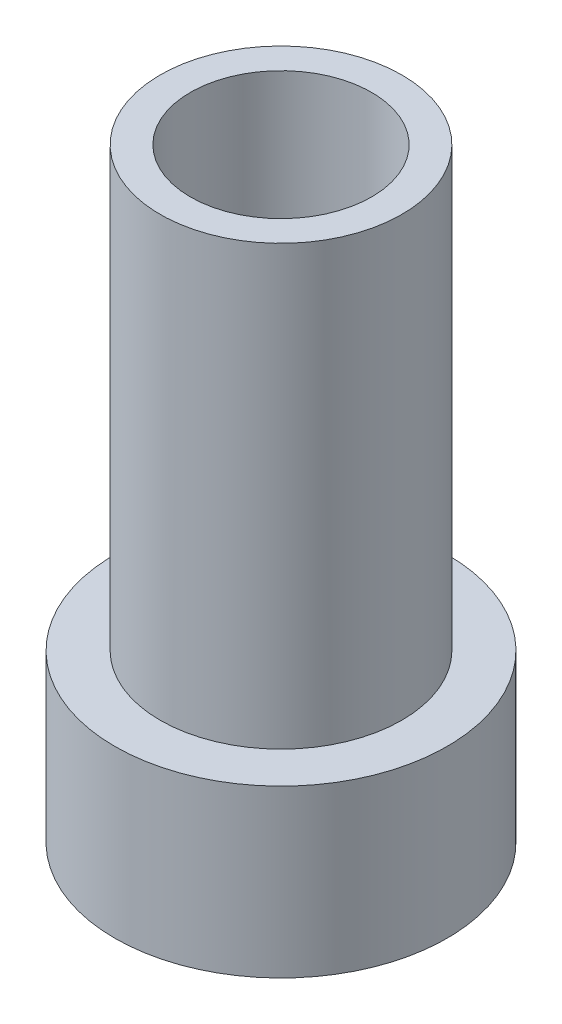
ISO-10303-21;
HEADER;
FILE_DESCRIPTION(('STEP AP214'),'2;1');
FILE_NAME('part.step','',(''),(''),'','','');
FILE_SCHEMA(('AUTOMOTIVE_DESIGN { 1 0 10303 214 1 1 1 1 }'));
ENDSEC;
DATA;
#1=APPLICATION_CONTEXT('core data for automotive mechanical design processes');
#2=APPLICATION_PROTOCOL_DEFINITION('international standard','automotive_design',2000,#1);
#3=PRODUCT_CONTEXT('',#1,'mechanical');
#4=PRODUCT('Part','Part','',(#3));
#5=PRODUCT_RELATED_PRODUCT_CATEGORY('part','',(#4));
#6=PRODUCT_DEFINITION_FORMATION('','',#4);
#7=PRODUCT_DEFINITION_CONTEXT('part definition',#1,'design');
#8=PRODUCT_DEFINITION('design','',#6,#7);
#9=PRODUCT_DEFINITION_SHAPE('','',#8);
#10=(LENGTH_UNIT() NAMED_UNIT(*) SI_UNIT(.MILLI.,.METRE.));
#11=(NAMED_UNIT(*) PLANE_ANGLE_UNIT() SI_UNIT($,.RADIAN.));
#12=(NAMED_UNIT(*) SI_UNIT($,.STERADIAN.) SOLID_ANGLE_UNIT());
#13=UNCERTAINTY_MEASURE_WITH_UNIT(LENGTH_MEASURE(1.E-05),#10,'distance_accuracy_value','');
#14=(GEOMETRIC_REPRESENTATION_CONTEXT(3) GLOBAL_UNCERTAINTY_ASSIGNED_CONTEXT((#13)) GLOBAL_UNIT_ASSIGNED_CONTEXT((#10,
#11,#12)) REPRESENTATION_CONTEXT('',''));
#15=CARTESIAN_POINT('',(0.,0.,0.));
#16=DIRECTION('',(0.,0.,1.));
#17=DIRECTION('',(1.,0.,0.));
#18=AXIS2_PLACEMENT_3D('',#15,#16,#17);
#19=CARTESIAN_POINT('',(0.,0.,0.));
#20=DIRECTION('',(0.,-1.,0.));
#21=DIRECTION('',(0.,0.,-1.));
#22=AXIS2_PLACEMENT_3D('',#19,#20,#21);
#23=CYLINDRICAL_SURFACE('',#22,5.5);
#24=CARTESIAN_POINT('',(0.,0.,0.));
#25=DIRECTION('',(0.,-1.,0.));
#26=DIRECTION('',(0.,0.,-1.));
#27=AXIS2_PLACEMENT_3D('',#24,#25,#26);
#28=CIRCLE('',#27,5.5);
#29=CARTESIAN_POINT('',(0.,0.,-5.5));
#30=VERTEX_POINT('',#29);
#31=EDGE_CURVE('E10',#30,#30,#28,.T.);
#32=ORIENTED_EDGE('',*,*,#31,.F.);
#33=EDGE_LOOP('',(#32));
#34=FACE_BOUND('',#33,.T.);
#35=CARTESIAN_POINT('',(0.,5.5,0.));
#36=DIRECTION('',(0.,1.,0.));
#37=DIRECTION('',(0.,0.,1.));
#38=AXIS2_PLACEMENT_3D('',#35,#36,#37);
#39=CIRCLE('',#38,5.5);
#40=CARTESIAN_POINT('',(0.,5.5,5.5));
#41=VERTEX_POINT('',#40);
#42=EDGE_CURVE('E57',#41,#41,#39,.T.);
#43=ORIENTED_EDGE('',*,*,#42,.F.);
#44=EDGE_LOOP('',(#43));
#45=FACE_BOUND('',#44,.T.);
#46=ADVANCED_FACE('F34',(#34,#45),#23,.T.);
#47=CARTESIAN_POINT('',(5.5,0.,0.));
#48=DIRECTION('',(0.,-1.,0.));
#49=DIRECTION('',(0.,0.,-1.));
#50=AXIS2_PLACEMENT_3D('',#47,#48,#49);
#51=PLANE('',#50);
#52=CARTESIAN_POINT('',(0.,0.,0.));
#53=DIRECTION('',(0.,-1.,0.));
#54=DIRECTION('',(0.,0.,-1.));
#55=AXIS2_PLACEMENT_3D('',#52,#53,#54);
#56=CIRCLE('',#55,2.);
#57=CARTESIAN_POINT('',(0.,0.,-2.));
#58=VERTEX_POINT('',#57);
#59=EDGE_CURVE('E54',#58,#58,#56,.T.);
#60=ORIENTED_EDGE('',*,*,#59,.F.);
#61=EDGE_LOOP('',(#60));
#62=FACE_BOUND('',#61,.T.);
#63=ORIENTED_EDGE('',*,*,#31,.T.);
#64=EDGE_LOOP('',(#63));
#65=FACE_BOUND('',#64,.T.);
#66=ADVANCED_FACE('F36',(#62,#65),#51,.T.);
#67=CARTESIAN_POINT('',(0.,0.,0.));
#68=DIRECTION('',(0.,-1.,0.));
#69=DIRECTION('',(0.,0.,-1.));
#70=AXIS2_PLACEMENT_3D('',#67,#68,#69);
#71=CYLINDRICAL_SURFACE('',#70,4.);
#72=CARTESIAN_POINT('',(0.,20.,0.));
#73=DIRECTION('',(0.,-1.,0.));
#74=DIRECTION('',(0.,0.,-1.));
#75=AXIS2_PLACEMENT_3D('',#72,#73,#74);
#76=CIRCLE('',#75,4.);
#77=CARTESIAN_POINT('',(0.,20.,-4.));
#78=VERTEX_POINT('',#77);
#79=EDGE_CURVE('E42',#78,#78,#76,.T.);
#80=ORIENTED_EDGE('',*,*,#79,.T.);
#81=EDGE_LOOP('',(#80));
#82=FACE_BOUND('',#81,.T.);
#83=CARTESIAN_POINT('',(0.,5.5,0.));
#84=DIRECTION('',(0.,1.,0.));
#85=DIRECTION('',(0.,0.,1.));
#86=AXIS2_PLACEMENT_3D('',#83,#84,#85);
#87=CIRCLE('',#86,4.);
#88=CARTESIAN_POINT('',(0.,5.5,4.));
#89=VERTEX_POINT('',#88);
#90=EDGE_CURVE('E60',#89,#89,#87,.T.);
#91=ORIENTED_EDGE('',*,*,#90,.T.);
#92=EDGE_LOOP('',(#91));
#93=FACE_BOUND('',#92,.T.);
#94=ADVANCED_FACE('F64',(#82,#93),#71,.T.);
#95=CARTESIAN_POINT('',(4.,20.,0.));
#96=DIRECTION('',(0.,1.,0.));
#97=DIRECTION('',(0.,0.,1.));
#98=AXIS2_PLACEMENT_3D('',#95,#96,#97);
#99=PLANE('',#98);
#100=CARTESIAN_POINT('',(0.,20.,0.));
#101=DIRECTION('',(0.,1.,0.));
#102=DIRECTION('',(0.,0.,1.));
#103=AXIS2_PLACEMENT_3D('',#100,#101,#102);
#104=CIRCLE('',#103,3.);
#105=CARTESIAN_POINT('',(0.,20.,3.));
#106=VERTEX_POINT('',#105);
#107=EDGE_CURVE('E49',#106,#106,#104,.T.);
#108=ORIENTED_EDGE('',*,*,#107,.F.);
#109=EDGE_LOOP('',(#108));
#110=FACE_BOUND('',#109,.T.);
#111=ORIENTED_EDGE('',*,*,#79,.F.);
#112=EDGE_LOOP('',(#111));
#113=FACE_BOUND('',#112,.T.);
#114=ADVANCED_FACE('F84',(#110,#113),#99,.T.);
#115=CARTESIAN_POINT('',(0.,10.,0.));
#116=DIRECTION('',(0.,1.,0.));
#117=DIRECTION('',(0.,0.,1.));
#118=AXIS2_PLACEMENT_3D('',#115,#116,#117);
#119=CYLINDRICAL_SURFACE('',#118,3.);
#120=CARTESIAN_POINT('',(0.,10.,0.));
#121=DIRECTION('',(0.,1.,0.));
#122=DIRECTION('',(0.,0.,1.));
#123=AXIS2_PLACEMENT_3D('',#120,#121,#122);
#124=CIRCLE('',#123,3.);
#125=CARTESIAN_POINT('',(0.,10.,3.));
#126=VERTEX_POINT('',#125);
#127=EDGE_CURVE('E46',#126,#126,#124,.T.);
#128=ORIENTED_EDGE('',*,*,#127,.F.);
#129=EDGE_LOOP('',(#128));
#130=FACE_BOUND('',#129,.T.);
#131=ORIENTED_EDGE('',*,*,#107,.T.);
#132=EDGE_LOOP('',(#131));
#133=FACE_BOUND('',#132,.T.);
#134=ADVANCED_FACE('F88',(#130,#133),#119,.F.);
#135=CARTESIAN_POINT('',(0.,10.,0.));
#136=DIRECTION('',(0.,1.,0.));
#137=DIRECTION('',(0.,0.,1.));
#138=AXIS2_PLACEMENT_3D('',#135,#136,#137);
#139=PLANE('',#138);
#140=CARTESIAN_POINT('',(0.,10.,0.));
#141=DIRECTION('',(0.,1.,0.));
#142=DIRECTION('',(0.,0.,1.));
#143=AXIS2_PLACEMENT_3D('',#140,#141,#142);
#144=CIRCLE('',#143,2.);
#145=CARTESIAN_POINT('',(0.,10.,2.));
#146=VERTEX_POINT('',#145);
#147=EDGE_CURVE('E38',#146,#146,#144,.T.);
#148=ORIENTED_EDGE('',*,*,#147,.F.);
#149=EDGE_LOOP('',(#148));
#150=FACE_BOUND('',#149,.T.);
#151=ORIENTED_EDGE('',*,*,#127,.T.);
#152=EDGE_LOOP('',(#151));
#153=FACE_BOUND('',#152,.T.);
#154=ADVANCED_FACE('F92',(#150,#153),#139,.T.);
#155=CARTESIAN_POINT('',(0.,20.,0.));
#156=DIRECTION('',(0.,-1.,0.));
#157=DIRECTION('',(0.,0.,-1.));
#158=AXIS2_PLACEMENT_3D('',#155,#156,#157);
#159=CYLINDRICAL_SURFACE('',#158,2.);
#160=ORIENTED_EDGE('',*,*,#147,.T.);
#161=EDGE_LOOP('',(#160));
#162=FACE_BOUND('',#161,.T.);
#163=ORIENTED_EDGE('',*,*,#59,.T.);
#164=EDGE_LOOP('',(#163));
#165=FACE_BOUND('',#164,.T.);
#166=ADVANCED_FACE('F69',(#162,#165),#159,.F.);
#167=CARTESIAN_POINT('',(0.,5.5,0.));
#168=DIRECTION('',(0.,1.,0.));
#169=DIRECTION('',(0.,0.,1.));
#170=AXIS2_PLACEMENT_3D('',#167,#168,#169);
#171=PLANE('',#170);
#172=ORIENTED_EDGE('',*,*,#90,.F.);
#173=EDGE_LOOP('',(#172));
#174=FACE_BOUND('',#173,.T.);
#175=ORIENTED_EDGE('',*,*,#42,.T.);
#176=EDGE_LOOP('',(#175));
#177=FACE_BOUND('',#176,.T.);
#178=ADVANCED_FACE('F66',(#174,#177),#171,.T.);
#179=CLOSED_SHELL('',(#46,#66,#94,#114,#134,#154,#166,#178));
#180=MANIFOLD_SOLID_BREP('B2',#179);
#181=ADVANCED_BREP_SHAPE_REPRESENTATION('',(#18,#180),#14);
#182=SHAPE_DEFINITION_REPRESENTATION(#9,#181);
ENDSEC;
END-ISO-10303-21;
